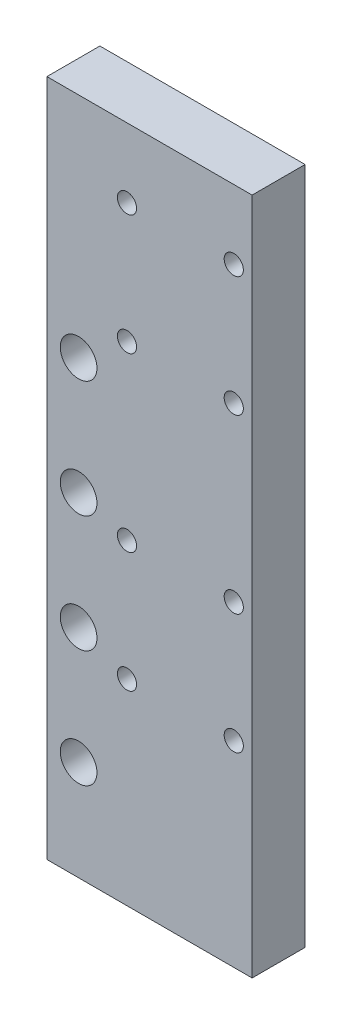
ISO-10303-21;
HEADER;
FILE_DESCRIPTION(('STEP AP214'),'2;1');
FILE_NAME('part.step','',(''),(''),'','','');
FILE_SCHEMA(('AUTOMOTIVE_DESIGN { 1 0 10303 214 1 1 1 1 }'));
ENDSEC;
DATA;
#1=APPLICATION_CONTEXT('core data for automotive mechanical design processes');
#2=APPLICATION_PROTOCOL_DEFINITION('international standard','automotive_design',2000,#1);
#3=PRODUCT_CONTEXT('',#1,'mechanical');
#4=PRODUCT('Part','Part','',(#3));
#5=PRODUCT_RELATED_PRODUCT_CATEGORY('part','',(#4));
#6=PRODUCT_DEFINITION_FORMATION('','',#4);
#7=PRODUCT_DEFINITION_CONTEXT('part definition',#1,'design');
#8=PRODUCT_DEFINITION('design','',#6,#7);
#9=PRODUCT_DEFINITION_SHAPE('','',#8);
#10=(LENGTH_UNIT() NAMED_UNIT(*) SI_UNIT(.MILLI.,.METRE.));
#11=(NAMED_UNIT(*) PLANE_ANGLE_UNIT() SI_UNIT($,.RADIAN.));
#12=(NAMED_UNIT(*) SI_UNIT($,.STERADIAN.) SOLID_ANGLE_UNIT());
#13=UNCERTAINTY_MEASURE_WITH_UNIT(LENGTH_MEASURE(1.E-05),#10,'distance_accuracy_value','');
#14=(GEOMETRIC_REPRESENTATION_CONTEXT(3) GLOBAL_UNCERTAINTY_ASSIGNED_CONTEXT((#13)) GLOBAL_UNIT_ASSIGNED_CONTEXT((#10,
#11,#12)) REPRESENTATION_CONTEXT('',''));
#15=CARTESIAN_POINT('',(0.,0.,0.));
#16=DIRECTION('',(0.,0.,1.));
#17=DIRECTION('',(1.,0.,0.));
#18=AXIS2_PLACEMENT_3D('',#15,#16,#17);
#19=CARTESIAN_POINT('',(30.75,101.6,7.9375));
#20=DIRECTION('',(-1.,0.,0.));
#21=DIRECTION('',(0.,-1.,0.));
#22=AXIS2_PLACEMENT_3D('',#19,#20,#21);
#23=PLANE('',#22);
#24=DIRECTION('',(0.,1.,0.));
#25=VECTOR('',#24,1.);
#26=CARTESIAN_POINT('',(30.75,101.6,-7.9375));
#27=LINE('',#26,#25);
#28=CARTESIAN_POINT('',(30.75,-101.6,-7.9375));
#29=VERTEX_POINT('',#28);
#30=CARTESIAN_POINT('',(30.75,101.6,-7.9375));
#31=VERTEX_POINT('',#30);
#32=EDGE_CURVE('E113',#29,#31,#27,.T.);
#33=ORIENTED_EDGE('',*,*,#32,.T.);
#34=DIRECTION('',(0.,0.,-1.));
#35=VECTOR('',#34,1.);
#36=CARTESIAN_POINT('',(30.75,101.6,7.9375));
#37=LINE('',#36,#35);
#38=CARTESIAN_POINT('',(30.75,101.6,7.9375));
#39=VERTEX_POINT('',#38);
#40=EDGE_CURVE('E11',#39,#31,#37,.T.);
#41=ORIENTED_EDGE('',*,*,#40,.F.);
#42=DIRECTION('',(0.,1.,0.));
#43=VECTOR('',#42,1.);
#44=CARTESIAN_POINT('',(30.75,101.6,7.9375));
#45=LINE('',#44,#43);
#46=CARTESIAN_POINT('',(30.75,-101.6,7.9375));
#47=VERTEX_POINT('',#46);
#48=EDGE_CURVE('E97',#47,#39,#45,.T.);
#49=ORIENTED_EDGE('',*,*,#48,.F.);
#50=DIRECTION('',(0.,0.,-1.));
#51=VECTOR('',#50,1.);
#52=CARTESIAN_POINT('',(30.75,-101.6,7.9375));
#53=LINE('',#52,#51);
#54=EDGE_CURVE('E109',#47,#29,#53,.T.);
#55=ORIENTED_EDGE('',*,*,#54,.T.);
#56=EDGE_LOOP('',(#33,#41,#49,#55));
#57=FACE_BOUND('',#56,.T.);
#58=ADVANCED_FACE('F45',(#57),#23,.F.);
#59=CARTESIAN_POINT('',(-30.75,101.6,7.9375));
#60=DIRECTION('',(0.,-1.,0.));
#61=DIRECTION('',(0.,0.,-1.));
#62=AXIS2_PLACEMENT_3D('',#59,#60,#61);
#63=PLANE('',#62);
#64=DIRECTION('',(-1.,0.,0.));
#65=VECTOR('',#64,1.);
#66=CARTESIAN_POINT('',(-30.75,101.6,-7.9375));
#67=LINE('',#66,#65);
#68=CARTESIAN_POINT('',(-30.75,101.6,-7.9375));
#69=VERTEX_POINT('',#68);
#70=EDGE_CURVE('E102',#31,#69,#67,.T.);
#71=ORIENTED_EDGE('',*,*,#70,.T.);
#72=DIRECTION('',(0.,0.,-1.));
#73=VECTOR('',#72,1.);
#74=CARTESIAN_POINT('',(-30.75,101.6,7.9375));
#75=LINE('',#74,#73);
#76=CARTESIAN_POINT('',(-30.75,101.6,7.9375));
#77=VERTEX_POINT('',#76);
#78=EDGE_CURVE('E54',#77,#69,#75,.T.);
#79=ORIENTED_EDGE('',*,*,#78,.F.);
#80=DIRECTION('',(-1.,0.,0.));
#81=VECTOR('',#80,1.);
#82=CARTESIAN_POINT('',(-30.75,101.6,7.9375));
#83=LINE('',#82,#81);
#84=EDGE_CURVE('E92',#39,#77,#83,.T.);
#85=ORIENTED_EDGE('',*,*,#84,.F.);
#86=ORIENTED_EDGE('',*,*,#40,.T.);
#87=EDGE_LOOP('',(#71,#79,#85,#86));
#88=FACE_BOUND('',#87,.T.);
#89=ADVANCED_FACE('F101',(#88),#63,.F.);
#90=CARTESIAN_POINT('',(-30.75,101.6,7.9375));
#91=DIRECTION('',(1.,0.,0.));
#92=DIRECTION('',(0.,1.,0.));
#93=AXIS2_PLACEMENT_3D('',#90,#91,#92);
#94=PLANE('',#93);
#95=DIRECTION('',(0.,-1.,0.));
#96=VECTOR('',#95,1.);
#97=CARTESIAN_POINT('',(-30.75,101.6,-7.9375));
#98=LINE('',#97,#96);
#99=CARTESIAN_POINT('',(-30.75,-101.6,-7.9375));
#100=VERTEX_POINT('',#99);
#101=EDGE_CURVE('E79',#69,#100,#98,.T.);
#102=ORIENTED_EDGE('',*,*,#101,.T.);
#103=DIRECTION('',(0.,0.,-1.));
#104=VECTOR('',#103,1.);
#105=CARTESIAN_POINT('',(-30.75,-101.6,7.9375));
#106=LINE('',#105,#104);
#107=CARTESIAN_POINT('',(-30.75,-101.6,7.9375));
#108=VERTEX_POINT('',#107);
#109=EDGE_CURVE('E104',#108,#100,#106,.T.);
#110=ORIENTED_EDGE('',*,*,#109,.F.);
#111=DIRECTION('',(0.,-1.,0.));
#112=VECTOR('',#111,1.);
#113=CARTESIAN_POINT('',(-30.75,101.6,7.9375));
#114=LINE('',#113,#112);
#115=EDGE_CURVE('E95',#77,#108,#114,.T.);
#116=ORIENTED_EDGE('',*,*,#115,.F.);
#117=ORIENTED_EDGE('',*,*,#78,.T.);
#118=EDGE_LOOP('',(#102,#110,#116,#117));
#119=FACE_BOUND('',#118,.T.);
#120=ADVANCED_FACE('F105',(#119),#94,.F.);
#121=CARTESIAN_POINT('',(-30.75,-101.6,7.9375));
#122=DIRECTION('',(0.,1.,0.));
#123=DIRECTION('',(0.,0.,1.));
#124=AXIS2_PLACEMENT_3D('',#121,#122,#123);
#125=PLANE('',#124);
#126=DIRECTION('',(1.,0.,0.));
#127=VECTOR('',#126,1.);
#128=CARTESIAN_POINT('',(-30.75,-101.6,-7.9375));
#129=LINE('',#128,#127);
#130=EDGE_CURVE('E85',#100,#29,#129,.T.);
#131=ORIENTED_EDGE('',*,*,#130,.T.);
#132=ORIENTED_EDGE('',*,*,#54,.F.);
#133=DIRECTION('',(1.,0.,0.));
#134=VECTOR('',#133,1.);
#135=CARTESIAN_POINT('',(-30.75,-101.6,7.9375));
#136=LINE('',#135,#134);
#137=EDGE_CURVE('E62',#108,#47,#136,.T.);
#138=ORIENTED_EDGE('',*,*,#137,.F.);
#139=ORIENTED_EDGE('',*,*,#109,.T.);
#140=EDGE_LOOP('',(#131,#132,#138,#139));
#141=FACE_BOUND('',#140,.T.);
#142=ADVANCED_FACE('F127',(#141),#125,.F.);
#143=CARTESIAN_POINT('',(0.,0.,7.9375));
#144=DIRECTION('',(0.,0.,1.));
#145=DIRECTION('',(1.,0.,0.));
#146=AXIS2_PLACEMENT_3D('',#143,#144,#145);
#147=PLANE('',#146);
#148=CARTESIAN_POINT('',(25.25,80.85,7.9375));
#149=DIRECTION('',(0.,0.,1.));
#150=DIRECTION('',(1.,0.,0.));
#151=AXIS2_PLACEMENT_3D('',#148,#149,#150);
#152=CIRCLE('',#151,2.875);
#153=CARTESIAN_POINT('',(28.125,80.85,7.9375));
#154=VERTEX_POINT('',#153);
#155=EDGE_CURVE('E222',#154,#154,#152,.T.);
#156=ORIENTED_EDGE('',*,*,#155,.F.);
#157=EDGE_LOOP('',(#156));
#158=FACE_BOUND('',#157,.T.);
#159=CARTESIAN_POINT('',(25.25,44.85,7.9375));
#160=DIRECTION('',(0.,0.,1.));
#161=DIRECTION('',(1.,0.,0.));
#162=AXIS2_PLACEMENT_3D('',#159,#160,#161);
#163=CIRCLE('',#162,2.875);
#164=CARTESIAN_POINT('',(28.125,44.85,7.9375));
#165=VERTEX_POINT('',#164);
#166=EDGE_CURVE('E214',#165,#165,#163,.T.);
#167=ORIENTED_EDGE('',*,*,#166,.F.);
#168=EDGE_LOOP('',(#167));
#169=FACE_BOUND('',#168,.T.);
#170=CARTESIAN_POINT('',(25.25,-6.75000000000002,7.9375));
#171=DIRECTION('',(0.,0.,1.));
#172=DIRECTION('',(1.,0.,0.));
#173=AXIS2_PLACEMENT_3D('',#170,#171,#172);
#174=CIRCLE('',#173,2.875);
#175=CARTESIAN_POINT('',(28.125,-6.75000000000002,7.9375));
#176=VERTEX_POINT('',#175);
#177=EDGE_CURVE('E206',#176,#176,#174,.T.);
#178=ORIENTED_EDGE('',*,*,#177,.F.);
#179=EDGE_LOOP('',(#178));
#180=FACE_BOUND('',#179,.T.);
#181=CARTESIAN_POINT('',(25.25,-42.75,7.9375));
#182=DIRECTION('',(0.,0.,1.));
#183=DIRECTION('',(1.,0.,0.));
#184=AXIS2_PLACEMENT_3D('',#181,#182,#183);
#185=CIRCLE('',#184,2.875);
#186=CARTESIAN_POINT('',(28.125,-42.75,7.9375));
#187=VERTEX_POINT('',#186);
#188=EDGE_CURVE('E198',#187,#187,#185,.T.);
#189=ORIENTED_EDGE('',*,*,#188,.F.);
#190=EDGE_LOOP('',(#189));
#191=FACE_BOUND('',#190,.T.);
#192=CARTESIAN_POINT('',(-6.75,80.85,7.9375));
#193=DIRECTION('',(0.,0.,1.));
#194=DIRECTION('',(1.,0.,0.));
#195=AXIS2_PLACEMENT_3D('',#192,#193,#194);
#196=CIRCLE('',#195,2.875);
#197=CARTESIAN_POINT('',(-3.875,80.85,7.9375));
#198=VERTEX_POINT('',#197);
#199=EDGE_CURVE('E191',#198,#198,#196,.T.);
#200=ORIENTED_EDGE('',*,*,#199,.F.);
#201=EDGE_LOOP('',(#200));
#202=FACE_BOUND('',#201,.T.);
#203=CARTESIAN_POINT('',(-6.75,44.85,7.9375));
#204=DIRECTION('',(0.,0.,1.));
#205=DIRECTION('',(1.,0.,0.));
#206=AXIS2_PLACEMENT_3D('',#203,#204,#205);
#207=CIRCLE('',#206,2.875);
#208=CARTESIAN_POINT('',(-3.875,44.85,7.9375));
#209=VERTEX_POINT('',#208);
#210=EDGE_CURVE('E187',#209,#209,#207,.T.);
#211=ORIENTED_EDGE('',*,*,#210,.F.);
#212=EDGE_LOOP('',(#211));
#213=FACE_BOUND('',#212,.T.);
#214=CARTESIAN_POINT('',(-6.74999999999999,-6.75000000000002,7.9375));
#215=DIRECTION('',(0.,0.,1.));
#216=DIRECTION('',(1.,0.,0.));
#217=AXIS2_PLACEMENT_3D('',#214,#215,#216);
#218=CIRCLE('',#217,2.875);
#219=CARTESIAN_POINT('',(-3.87499999999999,-6.75000000000002,7.9375));
#220=VERTEX_POINT('',#219);
#221=EDGE_CURVE('E179',#220,#220,#218,.T.);
#222=ORIENTED_EDGE('',*,*,#221,.F.);
#223=EDGE_LOOP('',(#222));
#224=FACE_BOUND('',#223,.T.);
#225=CARTESIAN_POINT('',(-6.74999999999999,-42.75,7.9375));
#226=DIRECTION('',(0.,0.,1.));
#227=DIRECTION('',(1.,0.,0.));
#228=AXIS2_PLACEMENT_3D('',#225,#226,#227);
#229=CIRCLE('',#228,2.875);
#230=CARTESIAN_POINT('',(-3.87499999999999,-42.75,7.9375));
#231=VERTEX_POINT('',#230);
#232=EDGE_CURVE('E170',#231,#231,#229,.T.);
#233=ORIENTED_EDGE('',*,*,#232,.F.);
#234=EDGE_LOOP('',(#233));
#235=FACE_BOUND('',#234,.T.);
#236=CARTESIAN_POINT('',(-21.25,33.4,7.9375));
#237=DIRECTION('',(0.,0.,1.));
#238=DIRECTION('',(1.,0.,0.));
#239=AXIS2_PLACEMENT_3D('',#236,#237,#238);
#240=CIRCLE('',#239,5.5);
#241=CARTESIAN_POINT('',(-15.75,33.4,7.9375));
#242=VERTEX_POINT('',#241);
#243=EDGE_CURVE('E159',#242,#242,#240,.T.);
#244=ORIENTED_EDGE('',*,*,#243,.F.);
#245=EDGE_LOOP('',(#244));
#246=FACE_BOUND('',#245,.T.);
#247=CARTESIAN_POINT('',(-21.25,-1.6,7.9375));
#248=DIRECTION('',(0.,0.,1.));
#249=DIRECTION('',(1.,0.,0.));
#250=AXIS2_PLACEMENT_3D('',#247,#248,#249);
#251=CIRCLE('',#250,5.5);
#252=CARTESIAN_POINT('',(-15.75,-1.6,7.9375));
#253=VERTEX_POINT('',#252);
#254=EDGE_CURVE('E155',#253,#253,#251,.T.);
#255=ORIENTED_EDGE('',*,*,#254,.F.);
#256=EDGE_LOOP('',(#255));
#257=FACE_BOUND('',#256,.T.);
#258=CARTESIAN_POINT('',(-21.25,-36.6,7.9375));
#259=DIRECTION('',(0.,0.,1.));
#260=DIRECTION('',(1.,0.,0.));
#261=AXIS2_PLACEMENT_3D('',#258,#259,#260);
#262=CIRCLE('',#261,5.5);
#263=CARTESIAN_POINT('',(-15.75,-36.6,7.9375));
#264=VERTEX_POINT('',#263);
#265=EDGE_CURVE('E147',#264,#264,#262,.T.);
#266=ORIENTED_EDGE('',*,*,#265,.F.);
#267=EDGE_LOOP('',(#266));
#268=FACE_BOUND('',#267,.T.);
#269=CARTESIAN_POINT('',(-21.25,-71.6,7.9375));
#270=DIRECTION('',(0.,0.,1.));
#271=DIRECTION('',(1.,0.,0.));
#272=AXIS2_PLACEMENT_3D('',#269,#270,#271);
#273=CIRCLE('',#272,5.5);
#274=CARTESIAN_POINT('',(-15.75,-71.6,7.9375));
#275=VERTEX_POINT('',#274);
#276=EDGE_CURVE('E138',#275,#275,#273,.T.);
#277=ORIENTED_EDGE('',*,*,#276,.F.);
#278=EDGE_LOOP('',(#277));
#279=FACE_BOUND('',#278,.T.);
#280=ORIENTED_EDGE('',*,*,#48,.T.);
#281=ORIENTED_EDGE('',*,*,#84,.T.);
#282=ORIENTED_EDGE('',*,*,#115,.T.);
#283=ORIENTED_EDGE('',*,*,#137,.T.);
#284=EDGE_LOOP('',(#280,#281,#282,#283));
#285=FACE_BOUND('',#284,.T.);
#286=ADVANCED_FACE('F93',(#158,#169,#180,#191,#202,#213,#224,#235,#246,#257,#268,#279,#285),
#147,.T.);
#287=CARTESIAN_POINT('',(0.,0.,-7.9375));
#288=DIRECTION('',(0.,0.,1.));
#289=DIRECTION('',(1.,0.,0.));
#290=AXIS2_PLACEMENT_3D('',#287,#288,#289);
#291=PLANE('',#290);
#292=CARTESIAN_POINT('',(25.25,80.85,-7.9375));
#293=DIRECTION('',(0.,0.,1.));
#294=DIRECTION('',(1.,0.,0.));
#295=AXIS2_PLACEMENT_3D('',#292,#293,#294);
#296=CIRCLE('',#295,2.875);
#297=CARTESIAN_POINT('',(28.125,80.85,-7.9375));
#298=VERTEX_POINT('',#297);
#299=EDGE_CURVE('E171',#298,#298,#296,.T.);
#300=ORIENTED_EDGE('',*,*,#299,.T.);
#301=EDGE_LOOP('',(#300));
#302=FACE_BOUND('',#301,.T.);
#303=CARTESIAN_POINT('',(25.25,44.85,-7.9375));
#304=DIRECTION('',(0.,0.,1.));
#305=DIRECTION('',(1.,0.,0.));
#306=AXIS2_PLACEMENT_3D('',#303,#304,#305);
#307=CIRCLE('',#306,2.875);
#308=CARTESIAN_POINT('',(28.125,44.85,-7.9375));
#309=VERTEX_POINT('',#308);
#310=EDGE_CURVE('E218',#309,#309,#307,.T.);
#311=ORIENTED_EDGE('',*,*,#310,.T.);
#312=EDGE_LOOP('',(#311));
#313=FACE_BOUND('',#312,.T.);
#314=CARTESIAN_POINT('',(25.25,-6.75000000000002,-7.9375));
#315=DIRECTION('',(0.,0.,1.));
#316=DIRECTION('',(1.,0.,0.));
#317=AXIS2_PLACEMENT_3D('',#314,#315,#316);
#318=CIRCLE('',#317,2.875);
#319=CARTESIAN_POINT('',(28.125,-6.75000000000002,-7.9375));
#320=VERTEX_POINT('',#319);
#321=EDGE_CURVE('E210',#320,#320,#318,.T.);
#322=ORIENTED_EDGE('',*,*,#321,.T.);
#323=EDGE_LOOP('',(#322));
#324=FACE_BOUND('',#323,.T.);
#325=CARTESIAN_POINT('',(25.25,-42.75,-7.9375));
#326=DIRECTION('',(0.,0.,1.));
#327=DIRECTION('',(1.,0.,0.));
#328=AXIS2_PLACEMENT_3D('',#325,#326,#327);
#329=CIRCLE('',#328,2.875);
#330=CARTESIAN_POINT('',(28.125,-42.75,-7.9375));
#331=VERTEX_POINT('',#330);
#332=EDGE_CURVE('E202',#331,#331,#329,.T.);
#333=ORIENTED_EDGE('',*,*,#332,.T.);
#334=EDGE_LOOP('',(#333));
#335=FACE_BOUND('',#334,.T.);
#336=CARTESIAN_POINT('',(-6.75,80.85,-7.9375));
#337=DIRECTION('',(0.,0.,1.));
#338=DIRECTION('',(1.,0.,0.));
#339=AXIS2_PLACEMENT_3D('',#336,#337,#338);
#340=CIRCLE('',#339,2.875);
#341=CARTESIAN_POINT('',(-3.875,80.85,-7.9375));
#342=VERTEX_POINT('',#341);
#343=EDGE_CURVE('E139',#342,#342,#340,.T.);
#344=ORIENTED_EDGE('',*,*,#343,.T.);
#345=EDGE_LOOP('',(#344));
#346=FACE_BOUND('',#345,.T.);
#347=CARTESIAN_POINT('',(-6.75,44.85,-7.9375));
#348=DIRECTION('',(0.,0.,1.));
#349=DIRECTION('',(1.,0.,0.));
#350=AXIS2_PLACEMENT_3D('',#347,#348,#349);
#351=CIRCLE('',#350,2.875);
#352=CARTESIAN_POINT('',(-3.875,44.85,-7.9375));
#353=VERTEX_POINT('',#352);
#354=EDGE_CURVE('E183',#353,#353,#351,.T.);
#355=ORIENTED_EDGE('',*,*,#354,.T.);
#356=EDGE_LOOP('',(#355));
#357=FACE_BOUND('',#356,.T.);
#358=CARTESIAN_POINT('',(-6.74999999999999,-6.75000000000002,-7.9375));
#359=DIRECTION('',(0.,0.,1.));
#360=DIRECTION('',(1.,0.,0.));
#361=AXIS2_PLACEMENT_3D('',#358,#359,#360);
#362=CIRCLE('',#361,2.875);
#363=CARTESIAN_POINT('',(-3.87499999999999,-6.75000000000002,-7.9375));
#364=VERTEX_POINT('',#363);
#365=EDGE_CURVE('E175',#364,#364,#362,.T.);
#366=ORIENTED_EDGE('',*,*,#365,.T.);
#367=EDGE_LOOP('',(#366));
#368=FACE_BOUND('',#367,.T.);
#369=CARTESIAN_POINT('',(-6.74999999999999,-42.75,-7.9375));
#370=DIRECTION('',(0.,0.,1.));
#371=DIRECTION('',(1.,0.,0.));
#372=AXIS2_PLACEMENT_3D('',#369,#370,#371);
#373=CIRCLE('',#372,2.875);
#374=CARTESIAN_POINT('',(-3.87499999999999,-42.75,-7.9375));
#375=VERTEX_POINT('',#374);
#376=EDGE_CURVE('E166',#375,#375,#373,.T.);
#377=ORIENTED_EDGE('',*,*,#376,.T.);
#378=EDGE_LOOP('',(#377));
#379=FACE_BOUND('',#378,.T.);
#380=CARTESIAN_POINT('',(-21.25,33.4,-7.9375));
#381=DIRECTION('',(0.,0.,1.));
#382=DIRECTION('',(1.,0.,0.));
#383=AXIS2_PLACEMENT_3D('',#380,#381,#382);
#384=CIRCLE('',#383,5.5);
#385=CARTESIAN_POINT('',(-15.75,33.4,-7.9375));
#386=VERTEX_POINT('',#385);
#387=EDGE_CURVE('E117',#386,#386,#384,.T.);
#388=ORIENTED_EDGE('',*,*,#387,.T.);
#389=EDGE_LOOP('',(#388));
#390=FACE_BOUND('',#389,.T.);
#391=CARTESIAN_POINT('',(-21.25,-1.6,-7.9375));
#392=DIRECTION('',(0.,0.,1.));
#393=DIRECTION('',(1.,0.,0.));
#394=AXIS2_PLACEMENT_3D('',#391,#392,#393);
#395=CIRCLE('',#394,5.5);
#396=CARTESIAN_POINT('',(-15.75,-1.6,-7.9375));
#397=VERTEX_POINT('',#396);
#398=EDGE_CURVE('E151',#397,#397,#395,.T.);
#399=ORIENTED_EDGE('',*,*,#398,.T.);
#400=EDGE_LOOP('',(#399));
#401=FACE_BOUND('',#400,.T.);
#402=CARTESIAN_POINT('',(-21.25,-36.6,-7.9375));
#403=DIRECTION('',(0.,0.,1.));
#404=DIRECTION('',(1.,0.,0.));
#405=AXIS2_PLACEMENT_3D('',#402,#403,#404);
#406=CIRCLE('',#405,5.5);
#407=CARTESIAN_POINT('',(-15.75,-36.6,-7.9375));
#408=VERTEX_POINT('',#407);
#409=EDGE_CURVE('E143',#408,#408,#406,.T.);
#410=ORIENTED_EDGE('',*,*,#409,.T.);
#411=EDGE_LOOP('',(#410));
#412=FACE_BOUND('',#411,.T.);
#413=CARTESIAN_POINT('',(-21.25,-71.6,-7.9375));
#414=DIRECTION('',(0.,0.,1.));
#415=DIRECTION('',(1.,0.,0.));
#416=AXIS2_PLACEMENT_3D('',#413,#414,#415);
#417=CIRCLE('',#416,5.5);
#418=CARTESIAN_POINT('',(-15.75,-71.6,-7.9375));
#419=VERTEX_POINT('',#418);
#420=EDGE_CURVE('E134',#419,#419,#417,.T.);
#421=ORIENTED_EDGE('',*,*,#420,.T.);
#422=EDGE_LOOP('',(#421));
#423=FACE_BOUND('',#422,.T.);
#424=ORIENTED_EDGE('',*,*,#32,.F.);
#425=ORIENTED_EDGE('',*,*,#130,.F.);
#426=ORIENTED_EDGE('',*,*,#101,.F.);
#427=ORIENTED_EDGE('',*,*,#70,.F.);
#428=EDGE_LOOP('',(#424,#425,#426,#427));
#429=FACE_BOUND('',#428,.T.);
#430=ADVANCED_FACE('F130',(#302,#313,#324,#335,#346,#357,#368,#379,#390,#401,#412,#423,#429),
#291,.F.);
#431=CARTESIAN_POINT('',(-21.25,-71.6,-7.9375));
#432=DIRECTION('',(0.,0.,1.));
#433=DIRECTION('',(1.,0.,0.));
#434=AXIS2_PLACEMENT_3D('',#431,#432,#433);
#435=CYLINDRICAL_SURFACE('',#434,5.5);
#436=ORIENTED_EDGE('',*,*,#420,.F.);
#437=EDGE_LOOP('',(#436));
#438=FACE_BOUND('',#437,.T.);
#439=ORIENTED_EDGE('',*,*,#276,.T.);
#440=EDGE_LOOP('',(#439));
#441=FACE_BOUND('',#440,.T.);
#442=ADVANCED_FACE('F264',(#438,#441),#435,.F.);
#443=CARTESIAN_POINT('',(-21.25,-36.6,-7.9375));
#444=DIRECTION('',(0.,0.,1.));
#445=DIRECTION('',(1.,0.,0.));
#446=AXIS2_PLACEMENT_3D('',#443,#444,#445);
#447=CYLINDRICAL_SURFACE('',#446,5.5);
#448=ORIENTED_EDGE('',*,*,#409,.F.);
#449=EDGE_LOOP('',(#448));
#450=FACE_BOUND('',#449,.T.);
#451=ORIENTED_EDGE('',*,*,#265,.T.);
#452=EDGE_LOOP('',(#451));
#453=FACE_BOUND('',#452,.T.);
#454=ADVANCED_FACE('F266',(#450,#453),#447,.F.);
#455=CARTESIAN_POINT('',(-21.25,-1.6,-7.9375));
#456=DIRECTION('',(0.,0.,1.));
#457=DIRECTION('',(1.,0.,0.));
#458=AXIS2_PLACEMENT_3D('',#455,#456,#457);
#459=CYLINDRICAL_SURFACE('',#458,5.5);
#460=ORIENTED_EDGE('',*,*,#398,.F.);
#461=EDGE_LOOP('',(#460));
#462=FACE_BOUND('',#461,.T.);
#463=ORIENTED_EDGE('',*,*,#254,.T.);
#464=EDGE_LOOP('',(#463));
#465=FACE_BOUND('',#464,.T.);
#466=ADVANCED_FACE('F273',(#462,#465),#459,.F.);
#467=CARTESIAN_POINT('',(-21.25,33.4,-7.9375));
#468=DIRECTION('',(0.,0.,1.));
#469=DIRECTION('',(1.,0.,0.));
#470=AXIS2_PLACEMENT_3D('',#467,#468,#469);
#471=CYLINDRICAL_SURFACE('',#470,5.5);
#472=ORIENTED_EDGE('',*,*,#387,.F.);
#473=EDGE_LOOP('',(#472));
#474=FACE_BOUND('',#473,.T.);
#475=ORIENTED_EDGE('',*,*,#243,.T.);
#476=EDGE_LOOP('',(#475));
#477=FACE_BOUND('',#476,.T.);
#478=ADVANCED_FACE('F332',(#474,#477),#471,.F.);
#479=CARTESIAN_POINT('',(-6.74999999999999,-42.75,-7.9375));
#480=DIRECTION('',(0.,0.,1.));
#481=DIRECTION('',(1.,0.,0.));
#482=AXIS2_PLACEMENT_3D('',#479,#480,#481);
#483=CYLINDRICAL_SURFACE('',#482,2.875);
#484=ORIENTED_EDGE('',*,*,#376,.F.);
#485=EDGE_LOOP('',(#484));
#486=FACE_BOUND('',#485,.T.);
#487=ORIENTED_EDGE('',*,*,#232,.T.);
#488=EDGE_LOOP('',(#487));
#489=FACE_BOUND('',#488,.T.);
#490=ADVANCED_FACE('F341',(#486,#489),#483,.F.);
#491=CARTESIAN_POINT('',(-6.74999999999999,-6.75000000000002,-7.9375));
#492=DIRECTION('',(0.,0.,1.));
#493=DIRECTION('',(1.,0.,0.));
#494=AXIS2_PLACEMENT_3D('',#491,#492,#493);
#495=CYLINDRICAL_SURFACE('',#494,2.875);
#496=ORIENTED_EDGE('',*,*,#365,.F.);
#497=EDGE_LOOP('',(#496));
#498=FACE_BOUND('',#497,.T.);
#499=ORIENTED_EDGE('',*,*,#221,.T.);
#500=EDGE_LOOP('',(#499));
#501=FACE_BOUND('',#500,.T.);
#502=ADVANCED_FACE('F350',(#498,#501),#495,.F.);
#503=CARTESIAN_POINT('',(-6.75,44.85,-7.9375));
#504=DIRECTION('',(0.,0.,1.));
#505=DIRECTION('',(1.,0.,0.));
#506=AXIS2_PLACEMENT_3D('',#503,#504,#505);
#507=CYLINDRICAL_SURFACE('',#506,2.875);
#508=ORIENTED_EDGE('',*,*,#354,.F.);
#509=EDGE_LOOP('',(#508));
#510=FACE_BOUND('',#509,.T.);
#511=ORIENTED_EDGE('',*,*,#210,.T.);
#512=EDGE_LOOP('',(#511));
#513=FACE_BOUND('',#512,.T.);
#514=ADVANCED_FACE('F359',(#510,#513),#507,.F.);
#515=CARTESIAN_POINT('',(-6.75,80.85,-7.9375));
#516=DIRECTION('',(0.,0.,1.));
#517=DIRECTION('',(1.,0.,0.));
#518=AXIS2_PLACEMENT_3D('',#515,#516,#517);
#519=CYLINDRICAL_SURFACE('',#518,2.875);
#520=ORIENTED_EDGE('',*,*,#343,.F.);
#521=EDGE_LOOP('',(#520));
#522=FACE_BOUND('',#521,.T.);
#523=ORIENTED_EDGE('',*,*,#199,.T.);
#524=EDGE_LOOP('',(#523));
#525=FACE_BOUND('',#524,.T.);
#526=ADVANCED_FACE('F368',(#522,#525),#519,.F.);
#527=CARTESIAN_POINT('',(25.25,-42.75,-7.9375));
#528=DIRECTION('',(0.,0.,1.));
#529=DIRECTION('',(1.,0.,0.));
#530=AXIS2_PLACEMENT_3D('',#527,#528,#529);
#531=CYLINDRICAL_SURFACE('',#530,2.875);
#532=ORIENTED_EDGE('',*,*,#332,.F.);
#533=EDGE_LOOP('',(#532));
#534=FACE_BOUND('',#533,.T.);
#535=ORIENTED_EDGE('',*,*,#188,.T.);
#536=EDGE_LOOP('',(#535));
#537=FACE_BOUND('',#536,.T.);
#538=ADVANCED_FACE('F377',(#534,#537),#531,.F.);
#539=CARTESIAN_POINT('',(25.25,-6.75000000000002,-7.9375));
#540=DIRECTION('',(0.,0.,1.));
#541=DIRECTION('',(1.,0.,0.));
#542=AXIS2_PLACEMENT_3D('',#539,#540,#541);
#543=CYLINDRICAL_SURFACE('',#542,2.875);
#544=ORIENTED_EDGE('',*,*,#321,.F.);
#545=EDGE_LOOP('',(#544));
#546=FACE_BOUND('',#545,.T.);
#547=ORIENTED_EDGE('',*,*,#177,.T.);
#548=EDGE_LOOP('',(#547));
#549=FACE_BOUND('',#548,.T.);
#550=ADVANCED_FACE('F386',(#546,#549),#543,.F.);
#551=CARTESIAN_POINT('',(25.25,44.85,-7.9375));
#552=DIRECTION('',(0.,0.,1.));
#553=DIRECTION('',(1.,0.,0.));
#554=AXIS2_PLACEMENT_3D('',#551,#552,#553);
#555=CYLINDRICAL_SURFACE('',#554,2.875);
#556=ORIENTED_EDGE('',*,*,#310,.F.);
#557=EDGE_LOOP('',(#556));
#558=FACE_BOUND('',#557,.T.);
#559=ORIENTED_EDGE('',*,*,#166,.T.);
#560=EDGE_LOOP('',(#559));
#561=FACE_BOUND('',#560,.T.);
#562=ADVANCED_FACE('F235',(#558,#561),#555,.F.);
#563=CARTESIAN_POINT('',(25.25,80.85,-7.9375));
#564=DIRECTION('',(0.,0.,1.));
#565=DIRECTION('',(1.,0.,0.));
#566=AXIS2_PLACEMENT_3D('',#563,#564,#565);
#567=CYLINDRICAL_SURFACE('',#566,2.875);
#568=ORIENTED_EDGE('',*,*,#299,.F.);
#569=EDGE_LOOP('',(#568));
#570=FACE_BOUND('',#569,.T.);
#571=ORIENTED_EDGE('',*,*,#155,.T.);
#572=EDGE_LOOP('',(#571));
#573=FACE_BOUND('',#572,.T.);
#574=ADVANCED_FACE('F232',(#570,#573),#567,.F.);
#575=CLOSED_SHELL('',(#58,#89,#120,#142,#286,#430,#442,#454,#466,#478,#490,#502,#514,#526,#538,
#550,#562,#574));
#576=MANIFOLD_SOLID_BREP('B2',#575);
#577=ADVANCED_BREP_SHAPE_REPRESENTATION('',(#18,#576),#14);
#578=SHAPE_DEFINITION_REPRESENTATION(#9,#577);
ENDSEC;
END-ISO-10303-21;
